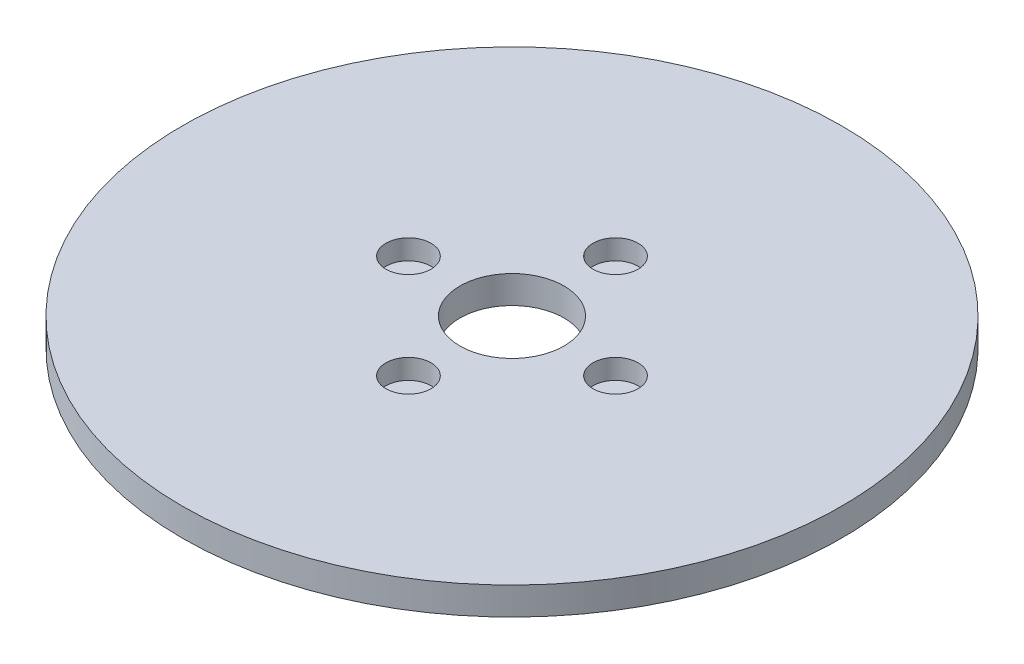
ISO-10303-21;
HEADER;
FILE_DESCRIPTION(('STEP AP214'),'2;1');
FILE_NAME('part.step','',(''),(''),'','','');
FILE_SCHEMA(('AUTOMOTIVE_DESIGN { 1 0 10303 214 1 1 1 1 }'));
ENDSEC;
DATA;
#1=APPLICATION_CONTEXT('core data for automotive mechanical design processes');
#2=APPLICATION_PROTOCOL_DEFINITION('international standard','automotive_design',2000,#1);
#3=PRODUCT_CONTEXT('',#1,'mechanical');
#4=PRODUCT('Part','Part','',(#3));
#5=PRODUCT_RELATED_PRODUCT_CATEGORY('part','',(#4));
#6=PRODUCT_DEFINITION_FORMATION('','',#4);
#7=PRODUCT_DEFINITION_CONTEXT('part definition',#1,'design');
#8=PRODUCT_DEFINITION('design','',#6,#7);
#9=PRODUCT_DEFINITION_SHAPE('','',#8);
#10=(LENGTH_UNIT() NAMED_UNIT(*) SI_UNIT(.MILLI.,.METRE.));
#11=(NAMED_UNIT(*) PLANE_ANGLE_UNIT() SI_UNIT($,.RADIAN.));
#12=(NAMED_UNIT(*) SI_UNIT($,.STERADIAN.) SOLID_ANGLE_UNIT());
#13=UNCERTAINTY_MEASURE_WITH_UNIT(LENGTH_MEASURE(1.E-05),#10,'distance_accuracy_value','');
#14=(GEOMETRIC_REPRESENTATION_CONTEXT(3) GLOBAL_UNCERTAINTY_ASSIGNED_CONTEXT((#13)) GLOBAL_UNIT_ASSIGNED_CONTEXT((#10,
#11,#12)) REPRESENTATION_CONTEXT('',''));
#15=CARTESIAN_POINT('',(0.,0.,0.));
#16=DIRECTION('',(0.,0.,1.));
#17=DIRECTION('',(1.,0.,0.));
#18=AXIS2_PLACEMENT_3D('',#15,#16,#17);
#19=CARTESIAN_POINT('',(0.,8.,0.));
#20=DIRECTION('',(0.,-1.,0.));
#21=DIRECTION('',(0.,0.,-1.));
#22=AXIS2_PLACEMENT_3D('',#19,#20,#21);
#23=CYLINDRICAL_SURFACE('',#22,95.);
#24=CARTESIAN_POINT('',(0.,8.,0.));
#25=DIRECTION('',(0.,1.,0.));
#26=DIRECTION('',(0.,0.,1.));
#27=AXIS2_PLACEMENT_3D('',#24,#25,#26);
#28=CIRCLE('',#27,95.);
#29=CARTESIAN_POINT('',(0.,8.,95.));
#30=VERTEX_POINT('',#29);
#31=EDGE_CURVE('E10',#30,#30,#28,.T.);
#32=ORIENTED_EDGE('',*,*,#31,.F.);
#33=EDGE_LOOP('',(#32));
#34=FACE_BOUND('',#33,.T.);
#35=CARTESIAN_POINT('',(0.,0.,0.));
#36=DIRECTION('',(0.,1.,0.));
#37=DIRECTION('',(0.,0.,1.));
#38=AXIS2_PLACEMENT_3D('',#35,#36,#37);
#39=CIRCLE('',#38,95.);
#40=CARTESIAN_POINT('',(0.,0.,95.));
#41=VERTEX_POINT('',#40);
#42=EDGE_CURVE('E37',#41,#41,#39,.T.);
#43=ORIENTED_EDGE('',*,*,#42,.T.);
#44=EDGE_LOOP('',(#43));
#45=FACE_BOUND('',#44,.T.);
#46=ADVANCED_FACE('F40',(#34,#45),#23,.T.);
#47=CARTESIAN_POINT('',(0.,8.,0.));
#48=DIRECTION('',(0.,1.,0.));
#49=DIRECTION('',(0.,0.,1.));
#50=AXIS2_PLACEMENT_3D('',#47,#48,#49);
#51=PLANE('',#50);
#52=CARTESIAN_POINT('',(1.04206870523359E-13,8.,29.8460339352371));
#53=DIRECTION('',(0.,1.,0.));
#54=DIRECTION('',(1.,0.,0.));
#55=AXIS2_PLACEMENT_3D('',#52,#53,#54);
#56=CIRCLE('',#55,6.49747488358835);
#57=CARTESIAN_POINT('',(1.04206870523359E-13,8.,36.3435088188255));
#58=VERTEX_POINT('',#57);
#59=EDGE_CURVE('E71',#58,#58,#56,.T.);
#60=ORIENTED_EDGE('',*,*,#59,.F.);
#61=EDGE_LOOP('',(#60));
#62=FACE_BOUND('',#61,.T.);
#63=CARTESIAN_POINT('',(29.8460339352371,8.,0.));
#64=DIRECTION('',(0.,1.,0.));
#65=DIRECTION('',(0.,0.,-1.));
#66=AXIS2_PLACEMENT_3D('',#63,#64,#65);
#67=CIRCLE('',#66,6.49747488358835);
#68=CARTESIAN_POINT('',(29.8460339352371,8.,6.49747488358835));
#69=VERTEX_POINT('',#68);
#70=EDGE_CURVE('E70',#69,#69,#67,.T.);
#71=ORIENTED_EDGE('',*,*,#70,.F.);
#72=EDGE_LOOP('',(#71));
#73=FACE_BOUND('',#72,.T.);
#74=CARTESIAN_POINT('',(-3.12620611570078E-13,8.,-29.8460339352371));
#75=DIRECTION('',(0.,1.,0.));
#76=DIRECTION('',(-1.,0.,0.));
#77=AXIS2_PLACEMENT_3D('',#74,#75,#76);
#78=CIRCLE('',#77,6.49747488358835);
#79=CARTESIAN_POINT('',(-3.12620611570078E-13,8.,-23.3485590516488));
#80=VERTEX_POINT('',#79);
#81=EDGE_CURVE('E61',#80,#80,#78,.T.);
#82=ORIENTED_EDGE('',*,*,#81,.F.);
#83=EDGE_LOOP('',(#82));
#84=FACE_BOUND('',#83,.T.);
#85=CARTESIAN_POINT('',(-29.8460339352371,8.,0.));
#86=DIRECTION('',(0.,1.,0.));
#87=DIRECTION('',(0.,0.,1.));
#88=AXIS2_PLACEMENT_3D('',#85,#86,#87);
#89=CIRCLE('',#88,6.49747488358835);
#90=CARTESIAN_POINT('',(-29.8460339352371,8.,6.49747488358835));
#91=VERTEX_POINT('',#90);
#92=EDGE_CURVE('E54',#91,#91,#89,.T.);
#93=ORIENTED_EDGE('',*,*,#92,.F.);
#94=EDGE_LOOP('',(#93));
#95=FACE_BOUND('',#94,.T.);
#96=CARTESIAN_POINT('',(0.,8.,0.));
#97=DIRECTION('',(0.,1.,0.));
#98=DIRECTION('',(0.,0.,1.));
#99=AXIS2_PLACEMENT_3D('',#96,#97,#98);
#100=CIRCLE('',#99,15.);
#101=CARTESIAN_POINT('',(0.,8.,15.));
#102=VERTEX_POINT('',#101);
#103=EDGE_CURVE('E50',#102,#102,#100,.T.);
#104=ORIENTED_EDGE('',*,*,#103,.F.);
#105=EDGE_LOOP('',(#104));
#106=FACE_BOUND('',#105,.T.);
#107=ORIENTED_EDGE('',*,*,#31,.T.);
#108=EDGE_LOOP('',(#107));
#109=FACE_BOUND('',#108,.T.);
#110=ADVANCED_FACE('F86',(#62,#73,#84,#95,#106,#109),#51,.T.);
#111=CARTESIAN_POINT('',(0.,0.,0.));
#112=DIRECTION('',(0.,1.,0.));
#113=DIRECTION('',(0.,0.,1.));
#114=AXIS2_PLACEMENT_3D('',#111,#112,#113);
#115=PLANE('',#114);
#116=CARTESIAN_POINT('',(0.,0.,0.));
#117=DIRECTION('',(0.,1.,0.));
#118=DIRECTION('',(0.,0.,1.));
#119=AXIS2_PLACEMENT_3D('',#116,#117,#118);
#120=CIRCLE('',#119,15.);
#121=CARTESIAN_POINT('',(0.,0.,15.));
#122=VERTEX_POINT('',#121);
#123=EDGE_CURVE('E47',#122,#122,#120,.T.);
#124=ORIENTED_EDGE('',*,*,#123,.T.);
#125=EDGE_LOOP('',(#124));
#126=FACE_BOUND('',#125,.T.);
#127=ORIENTED_EDGE('',*,*,#42,.F.);
#128=EDGE_LOOP('',(#127));
#129=FACE_BOUND('',#128,.T.);
#130=ADVANCED_FACE('F93',(#126,#129),#115,.F.);
#131=CARTESIAN_POINT('',(0.,8.,0.));
#132=DIRECTION('',(0.,-1.,0.));
#133=DIRECTION('',(0.,0.,-1.));
#134=AXIS2_PLACEMENT_3D('',#131,#132,#133);
#135=CYLINDRICAL_SURFACE('',#134,15.);
#136=ORIENTED_EDGE('',*,*,#103,.T.);
#137=EDGE_LOOP('',(#136));
#138=FACE_BOUND('',#137,.T.);
#139=ORIENTED_EDGE('',*,*,#123,.F.);
#140=EDGE_LOOP('',(#139));
#141=FACE_BOUND('',#140,.T.);
#142=ADVANCED_FACE('F101',(#138,#141),#135,.F.);
#143=CARTESIAN_POINT('',(-29.8460339352371,2.25266147835469,0.));
#144=DIRECTION('',(0.,1.,0.));
#145=DIRECTION('',(0.,0.,1.));
#146=AXIS2_PLACEMENT_3D('',#143,#144,#145);
#147=CYLINDRICAL_SURFACE('',#146,6.49747488358835);
#148=CARTESIAN_POINT('',(-29.8460339352371,2.25266147835469,0.));
#149=DIRECTION('',(0.,1.,0.));
#150=DIRECTION('',(0.,0.,1.));
#151=AXIS2_PLACEMENT_3D('',#148,#149,#150);
#152=CIRCLE('',#151,6.49747488358835);
#153=CARTESIAN_POINT('',(-29.8460339352371,2.25266147835469,6.49747488358835));
#154=VERTEX_POINT('',#153);
#155=EDGE_CURVE('E55',#154,#154,#152,.T.);
#156=CARTESIAN_POINT('',(-29.8460339352371,2.25266147835469,6.49747488358835));
#157=CARTESIAN_POINT('',(-29.8460339352371,2.31252958795517,6.49747488358835));
#158=CARTESIAN_POINT('',(-29.8460339352371,2.37239769755564,6.49747488358835));
#159=CARTESIAN_POINT('',(-29.8460339352371,2.49213391675658,6.49747488358835));
#160=CARTESIAN_POINT('',(-29.8460339352371,2.55200202635705,6.49747488358835));
#161=CARTESIAN_POINT('',(-29.8460339352371,2.671738245558,6.49747488358835));
#162=CARTESIAN_POINT('',(-29.8460339352371,2.73160635515847,6.49747488358835));
#163=CARTESIAN_POINT('',(-29.8460339352371,2.85134257435941,6.49747488358835));
#164=CARTESIAN_POINT('',(-29.8460339352371,2.91121068395989,6.49747488358835));
#165=CARTESIAN_POINT('',(-29.8460339352371,3.03094690316083,6.49747488358835));
#166=CARTESIAN_POINT('',(-29.8460339352371,3.0908150127613,6.49747488358835));
#167=CARTESIAN_POINT('',(-29.8460339352371,3.21055123196224,6.49747488358835));
#168=CARTESIAN_POINT('',(-29.8460339352371,3.27041934156272,6.49747488358835));
#169=CARTESIAN_POINT('',(-29.8460339352371,3.39015556076366,6.49747488358835));
#170=CARTESIAN_POINT('',(-29.8460339352371,3.45002367036413,6.49747488358835));
#171=CARTESIAN_POINT('',(-29.8460339352371,3.56975988956508,6.49747488358835));
#172=CARTESIAN_POINT('',(-29.8460339352371,3.62962799916555,6.49747488358835));
#173=CARTESIAN_POINT('',(-29.8460339352371,3.74936421836649,6.49747488358835));
#174=CARTESIAN_POINT('',(-29.8460339352371,3.80923232796696,6.49747488358835));
#175=CARTESIAN_POINT('',(-29.8460339352371,3.92896854716791,6.49747488358835));
#176=CARTESIAN_POINT('',(-29.8460339352371,3.98883665676838,6.49747488358835));
#177=CARTESIAN_POINT('',(-29.8460339352371,4.10857287596932,6.49747488358835));
#178=CARTESIAN_POINT('',(-29.8460339352371,4.1684409855698,6.49747488358835));
#179=CARTESIAN_POINT('',(-29.8460339352371,4.28817720477074,6.49747488358835));
#180=CARTESIAN_POINT('',(-29.8460339352371,4.34804531437121,6.49747488358835));
#181=CARTESIAN_POINT('',(-29.8460339352371,4.46778153357215,6.49747488358835));
#182=CARTESIAN_POINT('',(-29.8460339352371,4.52764964317263,6.49747488358835));
#183=CARTESIAN_POINT('',(-29.8460339352371,4.64738586237357,6.49747488358835));
#184=CARTESIAN_POINT('',(-29.8460339352371,4.70725397197404,6.49747488358835));
#185=CARTESIAN_POINT('',(-29.8460339352371,4.82699019117499,6.49747488358835));
#186=CARTESIAN_POINT('',(-29.8460339352371,4.88685830077546,6.49747488358835));
#187=CARTESIAN_POINT('',(-29.8460339352371,5.0065945199764,6.49747488358835));
#188=CARTESIAN_POINT('',(-29.8460339352371,5.06646262957687,6.49747488358835));
#189=CARTESIAN_POINT('',(-29.8460339352371,5.18619884877782,6.49747488358835));
#190=CARTESIAN_POINT('',(-29.8460339352371,5.24606695837829,6.49747488358835));
#191=CARTESIAN_POINT('',(-29.8460339352371,5.36580317757923,6.49747488358835));
#192=CARTESIAN_POINT('',(-29.8460339352371,5.42567128717971,6.49747488358835));
#193=CARTESIAN_POINT('',(-29.8460339352371,5.54540750638065,6.49747488358835));
#194=CARTESIAN_POINT('',(-29.8460339352371,5.60527561598112,6.49747488358835));
#195=CARTESIAN_POINT('',(-29.8460339352371,5.72501183518207,6.49747488358835));
#196=CARTESIAN_POINT('',(-29.8460339352371,5.78487994478254,6.49747488358835));
#197=CARTESIAN_POINT('',(-29.8460339352371,5.90461616398348,6.49747488358835));
#198=CARTESIAN_POINT('',(-29.8460339352371,5.96448427358395,6.49747488358835));
#199=CARTESIAN_POINT('',(-29.8460339352371,6.0842204927849,6.49747488358835));
#200=CARTESIAN_POINT('',(-29.8460339352371,6.14408860238537,6.49747488358835));
#201=CARTESIAN_POINT('',(-29.8460339352371,6.26382482158631,6.49747488358835));
#202=CARTESIAN_POINT('',(-29.8460339352371,6.32369293118678,6.49747488358835));
#203=CARTESIAN_POINT('',(-29.8460339352371,6.44342915038773,6.49747488358835));
#204=CARTESIAN_POINT('',(-29.8460339352371,6.5032972599882,6.49747488358835));
#205=CARTESIAN_POINT('',(-29.8460339352371,6.62303347918914,6.49747488358835));
#206=CARTESIAN_POINT('',(-29.8460339352371,6.68290158878962,6.49747488358835));
#207=CARTESIAN_POINT('',(-29.8460339352371,6.80263780799056,6.49747488358835));
#208=CARTESIAN_POINT('',(-29.8460339352371,6.86250591759103,6.49747488358835));
#209=CARTESIAN_POINT('',(-29.8460339352371,6.98224213679198,6.49747488358835));
#210=CARTESIAN_POINT('',(-29.8460339352371,7.04211024639245,6.49747488358835));
#211=CARTESIAN_POINT('',(-29.8460339352371,7.16184646559339,6.49747488358835));
#212=CARTESIAN_POINT('',(-29.8460339352371,7.22171457519386,6.49747488358835));
#213=CARTESIAN_POINT('',(-29.8460339352371,7.34145079439481,6.49747488358835));
#214=CARTESIAN_POINT('',(-29.8460339352371,7.40131890399528,6.49747488358835));
#215=CARTESIAN_POINT('',(-29.8460339352371,7.52105512319622,6.49747488358835));
#216=CARTESIAN_POINT('',(-29.8460339352371,7.5809232327967,6.49747488358835));
#217=CARTESIAN_POINT('',(-29.8460339352371,7.70065945199764,6.49747488358835));
#218=CARTESIAN_POINT('',(-29.8460339352371,7.76052756159811,6.49747488358835));
#219=CARTESIAN_POINT('',(-29.8460339352371,7.88026378079906,6.49747488358835));
#220=CARTESIAN_POINT('',(-29.8460339352371,7.94013189039953,6.49747488358835));
#221=CARTESIAN_POINT('',(-29.8460339352371,8.,6.49747488358835));
#222=B_SPLINE_CURVE_WITH_KNOTS('',3,(#156,#157,#158,#159,#160,#161,#162,#163,#164,#165,#166,
#167,#168,#169,#170,#171,#172,#173,#174,#175,#176,#177,#178,#179,#180,#181,#182,#183,#184,#185,
#186,#187,#188,#189,#190,#191,#192,#193,#194,#195,#196,#197,#198,#199,#200,#201,#202,#203,#204,
#205,#206,#207,#208,#209,#210,#211,#212,#213,#214,#215,#216,#217,#218,#219,#220,#221),
.UNSPECIFIED.,.F.,.F.,(4,2,2,2,2,2,2,2,2,2,2,2,2,2,2,2,2,2,2,2,2,2,2,2,2,2,2,2,2,2,2,2,4),(0.,
0.179604328801416,0.359208657602832,0.538812986404247,0.718417315205663,0.898021644007079,
1.07762597280849,1.25723030160991,1.43683463041133,1.61643895921274,1.79604328801416,
1.97564761681557,2.15525194561699,2.3348562744184,2.51446060321982,2.69406493202124,
2.87366926082265,3.05327358962407,3.23287791842548,3.4124822472269,3.59208657602831,
3.77169090482973,3.95129523363115,4.13089956243256,4.31050389123398,4.49010822003539,
4.66971254883681,4.84931687763822,5.02892120643964,5.20852553524106,5.38812986404247,
5.56773419284389,5.7473385216453),.UNSPECIFIED.);
#223=EDGE_CURVE('BSEAM102',#154,#91,#222,.T.);
#224=ORIENTED_EDGE('',*,*,#155,.F.);
#225=ORIENTED_EDGE('',*,*,#92,.T.);
#226=ORIENTED_EDGE('',*,*,#223,.T.);
#227=ORIENTED_EDGE('',*,*,#223,.F.);
#228=EDGE_LOOP('',(#224,#226,#225,#227));
#229=FACE_BOUND('',#228,.T.);
#230=ADVANCED_FACE('F102',(#229),#147,.F.);
#231=CARTESIAN_POINT('',(-29.8460339352371,2.25266147835469,0.));
#232=DIRECTION('',(0.,1.,0.));
#233=DIRECTION('',(0.,0.,1.));
#234=AXIS2_PLACEMENT_3D('',#231,#232,#233);
#235=PLANE('',#234);
#236=ORIENTED_EDGE('',*,*,#155,.T.);
#237=EDGE_LOOP('',(#236));
#238=FACE_BOUND('',#237,.T.);
#239=ADVANCED_FACE('F133',(#238),#235,.T.);
#240=CARTESIAN_POINT('',(-3.12620611570078E-13,2.25266147835469,-29.8460339352371));
#241=DIRECTION('',(0.,1.,0.));
#242=DIRECTION('',(0.,0.,1.));
#243=AXIS2_PLACEMENT_3D('',#240,#241,#242);
#244=CYLINDRICAL_SURFACE('',#243,6.49747488358835);
#245=CARTESIAN_POINT('',(-3.12620611570078E-13,2.25266147835469,-29.8460339352371));
#246=DIRECTION('',(0.,1.,0.));
#247=DIRECTION('',(-1.,0.,0.));
#248=AXIS2_PLACEMENT_3D('',#245,#246,#247);
#249=CIRCLE('',#248,6.49747488358835);
#250=CARTESIAN_POINT('',(-3.12620611570078E-13,2.25266147835469,-23.3485590516488));
#251=VERTEX_POINT('',#250);
#252=EDGE_CURVE('E63',#251,#251,#249,.T.);
#253=CARTESIAN_POINT('',(-3.12620611570078E-13,2.25266147835469,-23.3485590516488));
#254=CARTESIAN_POINT('',(-3.12620611570078E-13,2.31252958795517,-23.3485590516488));
#255=CARTESIAN_POINT('',(-3.12620611570078E-13,2.37239769755564,-23.3485590516488));
#256=CARTESIAN_POINT('',(-3.12620611570078E-13,2.49213391675658,-23.3485590516488));
#257=CARTESIAN_POINT('',(-3.12620611570078E-13,2.55200202635705,-23.3485590516488));
#258=CARTESIAN_POINT('',(-3.12620611570078E-13,2.671738245558,-23.3485590516488));
#259=CARTESIAN_POINT('',(-3.12620611570078E-13,2.73160635515847,-23.3485590516488));
#260=CARTESIAN_POINT('',(-3.12620611570078E-13,2.85134257435941,-23.3485590516488));
#261=CARTESIAN_POINT('',(-3.12620611570078E-13,2.91121068395989,-23.3485590516488));
#262=CARTESIAN_POINT('',(-3.12620611570078E-13,3.03094690316083,-23.3485590516488));
#263=CARTESIAN_POINT('',(-3.12620611570078E-13,3.0908150127613,-23.3485590516488));
#264=CARTESIAN_POINT('',(-3.12620611570078E-13,3.21055123196224,-23.3485590516488));
#265=CARTESIAN_POINT('',(-3.12620611570078E-13,3.27041934156272,-23.3485590516488));
#266=CARTESIAN_POINT('',(-3.12620611570078E-13,3.39015556076366,-23.3485590516488));
#267=CARTESIAN_POINT('',(-3.12620611570078E-13,3.45002367036413,-23.3485590516488));
#268=CARTESIAN_POINT('',(-3.12620611570078E-13,3.56975988956508,-23.3485590516488));
#269=CARTESIAN_POINT('',(-3.12620611570078E-13,3.62962799916555,-23.3485590516488));
#270=CARTESIAN_POINT('',(-3.12620611570078E-13,3.74936421836649,-23.3485590516488));
#271=CARTESIAN_POINT('',(-3.12620611570078E-13,3.80923232796696,-23.3485590516488));
#272=CARTESIAN_POINT('',(-3.12620611570078E-13,3.92896854716791,-23.3485590516488));
#273=CARTESIAN_POINT('',(-3.12620611570078E-13,3.98883665676838,-23.3485590516488));
#274=CARTESIAN_POINT('',(-3.12620611570078E-13,4.10857287596932,-23.3485590516488));
#275=CARTESIAN_POINT('',(-3.12620611570078E-13,4.1684409855698,-23.3485590516488));
#276=CARTESIAN_POINT('',(-3.12620611570078E-13,4.28817720477074,-23.3485590516488));
#277=CARTESIAN_POINT('',(-3.12620611570078E-13,4.34804531437121,-23.3485590516488));
#278=CARTESIAN_POINT('',(-3.12620611570078E-13,4.46778153357215,-23.3485590516488));
#279=CARTESIAN_POINT('',(-3.12620611570078E-13,4.52764964317263,-23.3485590516488));
#280=CARTESIAN_POINT('',(-3.12620611570078E-13,4.64738586237357,-23.3485590516488));
#281=CARTESIAN_POINT('',(-3.12620611570078E-13,4.70725397197404,-23.3485590516488));
#282=CARTESIAN_POINT('',(-3.12620611570078E-13,4.82699019117499,-23.3485590516488));
#283=CARTESIAN_POINT('',(-3.12620611570078E-13,4.88685830077546,-23.3485590516488));
#284=CARTESIAN_POINT('',(-3.12620611570078E-13,5.0065945199764,-23.3485590516488));
#285=CARTESIAN_POINT('',(-3.12620611570078E-13,5.06646262957687,-23.3485590516488));
#286=CARTESIAN_POINT('',(-3.12620611570078E-13,5.18619884877782,-23.3485590516488));
#287=CARTESIAN_POINT('',(-3.12620611570078E-13,5.24606695837829,-23.3485590516488));
#288=CARTESIAN_POINT('',(-3.12620611570078E-13,5.36580317757923,-23.3485590516488));
#289=CARTESIAN_POINT('',(-3.12620611570078E-13,5.42567128717971,-23.3485590516488));
#290=CARTESIAN_POINT('',(-3.12620611570078E-13,5.54540750638065,-23.3485590516488));
#291=CARTESIAN_POINT('',(-3.12620611570078E-13,5.60527561598112,-23.3485590516488));
#292=CARTESIAN_POINT('',(-3.12620611570078E-13,5.72501183518207,-23.3485590516488));
#293=CARTESIAN_POINT('',(-3.12620611570078E-13,5.78487994478254,-23.3485590516488));
#294=CARTESIAN_POINT('',(-3.12620611570078E-13,5.90461616398348,-23.3485590516488));
#295=CARTESIAN_POINT('',(-3.12620611570078E-13,5.96448427358395,-23.3485590516488));
#296=CARTESIAN_POINT('',(-3.12620611570078E-13,6.0842204927849,-23.3485590516488));
#297=CARTESIAN_POINT('',(-3.12620611570078E-13,6.14408860238537,-23.3485590516488));
#298=CARTESIAN_POINT('',(-3.12620611570078E-13,6.26382482158631,-23.3485590516488));
#299=CARTESIAN_POINT('',(-3.12620611570078E-13,6.32369293118678,-23.3485590516488));
#300=CARTESIAN_POINT('',(-3.12620611570078E-13,6.44342915038773,-23.3485590516488));
#301=CARTESIAN_POINT('',(-3.12620611570078E-13,6.5032972599882,-23.3485590516488));
#302=CARTESIAN_POINT('',(-3.12620611570078E-13,6.62303347918914,-23.3485590516488));
#303=CARTESIAN_POINT('',(-3.12620611570078E-13,6.68290158878962,-23.3485590516488));
#304=CARTESIAN_POINT('',(-3.12620611570078E-13,6.80263780799056,-23.3485590516488));
#305=CARTESIAN_POINT('',(-3.12620611570078E-13,6.86250591759103,-23.3485590516488));
#306=CARTESIAN_POINT('',(-3.12620611570078E-13,6.98224213679198,-23.3485590516488));
#307=CARTESIAN_POINT('',(-3.12620611570078E-13,7.04211024639245,-23.3485590516488));
#308=CARTESIAN_POINT('',(-3.12620611570078E-13,7.16184646559339,-23.3485590516488));
#309=CARTESIAN_POINT('',(-3.12620611570078E-13,7.22171457519386,-23.3485590516488));
#310=CARTESIAN_POINT('',(-3.12620611570078E-13,7.34145079439481,-23.3485590516488));
#311=CARTESIAN_POINT('',(-3.12620611570078E-13,7.40131890399528,-23.3485590516488));
#312=CARTESIAN_POINT('',(-3.12620611570078E-13,7.52105512319622,-23.3485590516488));
#313=CARTESIAN_POINT('',(-3.12620611570078E-13,7.5809232327967,-23.3485590516488));
#314=CARTESIAN_POINT('',(-3.12620611570078E-13,7.70065945199764,-23.3485590516488));
#315=CARTESIAN_POINT('',(-3.12620611570078E-13,7.76052756159811,-23.3485590516488));
#316=CARTESIAN_POINT('',(-3.12620611570078E-13,7.88026378079906,-23.3485590516488));
#317=CARTESIAN_POINT('',(-3.12620611570078E-13,7.94013189039953,-23.3485590516488));
#318=CARTESIAN_POINT('',(-3.12620611570078E-13,8.,-23.3485590516488));
#319=B_SPLINE_CURVE_WITH_KNOTS('',3,(#253,#254,#255,#256,#257,#258,#259,#260,#261,#262,#263,
#264,#265,#266,#267,#268,#269,#270,#271,#272,#273,#274,#275,#276,#277,#278,#279,#280,#281,#282,
#283,#284,#285,#286,#287,#288,#289,#290,#291,#292,#293,#294,#295,#296,#297,#298,#299,#300,#301,
#302,#303,#304,#305,#306,#307,#308,#309,#310,#311,#312,#313,#314,#315,#316,#317,#318),
.UNSPECIFIED.,.F.,.F.,(4,2,2,2,2,2,2,2,2,2,2,2,2,2,2,2,2,2,2,2,2,2,2,2,2,2,2,2,2,2,2,2,4),(0.,
0.179604328801416,0.359208657602832,0.538812986404247,0.718417315205663,0.898021644007079,
1.07762597280849,1.25723030160991,1.43683463041133,1.61643895921274,1.79604328801416,
1.97564761681557,2.15525194561699,2.3348562744184,2.51446060321982,2.69406493202124,
2.87366926082265,3.05327358962407,3.23287791842548,3.4124822472269,3.59208657602831,
3.77169090482973,3.95129523363115,4.13089956243256,4.31050389123398,4.49010822003539,
4.66971254883681,4.84931687763822,5.02892120643964,5.20852553524106,5.38812986404247,
5.56773419284389,5.7473385216453),.UNSPECIFIED.);
#320=EDGE_CURVE('BSEAM142',#251,#80,#319,.T.);
#321=ORIENTED_EDGE('',*,*,#252,.F.);
#322=ORIENTED_EDGE('',*,*,#81,.T.);
#323=ORIENTED_EDGE('',*,*,#320,.T.);
#324=ORIENTED_EDGE('',*,*,#320,.F.);
#325=EDGE_LOOP('',(#321,#323,#322,#324));
#326=FACE_BOUND('',#325,.T.);
#327=ADVANCED_FACE('F142',(#326),#244,.F.);
#328=CARTESIAN_POINT('',(-3.12620611570078E-13,2.25266147835469,-29.8460339352371));
#329=DIRECTION('',(0.,1.,0.));
#330=DIRECTION('',(-1.,0.,0.));
#331=AXIS2_PLACEMENT_3D('',#328,#329,#330);
#332=PLANE('',#331);
#333=ORIENTED_EDGE('',*,*,#252,.T.);
#334=EDGE_LOOP('',(#333));
#335=FACE_BOUND('',#334,.T.);
#336=ADVANCED_FACE('F156',(#335),#332,.T.);
#337=CARTESIAN_POINT('',(29.8460339352371,2.25266147835469,0.));
#338=DIRECTION('',(0.,1.,0.));
#339=DIRECTION('',(0.,0.,1.));
#340=AXIS2_PLACEMENT_3D('',#337,#338,#339);
#341=CYLINDRICAL_SURFACE('',#340,6.49747488358835);
#342=CARTESIAN_POINT('',(29.8460339352371,2.25266147835469,0.));
#343=DIRECTION('',(0.,1.,0.));
#344=DIRECTION('',(0.,0.,-1.));
#345=AXIS2_PLACEMENT_3D('',#342,#343,#344);
#346=CIRCLE('',#345,6.49747488358835);
#347=CARTESIAN_POINT('',(29.8460339352371,2.25266147835469,6.49747488358835));
#348=VERTEX_POINT('',#347);
#349=EDGE_CURVE('E69',#348,#348,#346,.T.);
#350=CARTESIAN_POINT('',(29.8460339352371,2.25266147835469,6.49747488358835));
#351=CARTESIAN_POINT('',(29.8460339352371,2.31252958795517,6.49747488358835));
#352=CARTESIAN_POINT('',(29.8460339352371,2.37239769755564,6.49747488358835));
#353=CARTESIAN_POINT('',(29.8460339352371,2.49213391675658,6.49747488358835));
#354=CARTESIAN_POINT('',(29.8460339352371,2.55200202635705,6.49747488358835));
#355=CARTESIAN_POINT('',(29.8460339352371,2.671738245558,6.49747488358835));
#356=CARTESIAN_POINT('',(29.8460339352371,2.73160635515847,6.49747488358835));
#357=CARTESIAN_POINT('',(29.8460339352371,2.85134257435941,6.49747488358835));
#358=CARTESIAN_POINT('',(29.8460339352371,2.91121068395989,6.49747488358835));
#359=CARTESIAN_POINT('',(29.8460339352371,3.03094690316083,6.49747488358835));
#360=CARTESIAN_POINT('',(29.8460339352371,3.0908150127613,6.49747488358835));
#361=CARTESIAN_POINT('',(29.8460339352371,3.21055123196224,6.49747488358835));
#362=CARTESIAN_POINT('',(29.8460339352371,3.27041934156272,6.49747488358835));
#363=CARTESIAN_POINT('',(29.8460339352371,3.39015556076366,6.49747488358835));
#364=CARTESIAN_POINT('',(29.8460339352371,3.45002367036413,6.49747488358835));
#365=CARTESIAN_POINT('',(29.8460339352371,3.56975988956508,6.49747488358835));
#366=CARTESIAN_POINT('',(29.8460339352371,3.62962799916555,6.49747488358835));
#367=CARTESIAN_POINT('',(29.8460339352371,3.74936421836649,6.49747488358835));
#368=CARTESIAN_POINT('',(29.8460339352371,3.80923232796696,6.49747488358835));
#369=CARTESIAN_POINT('',(29.8460339352371,3.92896854716791,6.49747488358835));
#370=CARTESIAN_POINT('',(29.8460339352371,3.98883665676838,6.49747488358835));
#371=CARTESIAN_POINT('',(29.8460339352371,4.10857287596932,6.49747488358835));
#372=CARTESIAN_POINT('',(29.8460339352371,4.1684409855698,6.49747488358835));
#373=CARTESIAN_POINT('',(29.8460339352371,4.28817720477074,6.49747488358835));
#374=CARTESIAN_POINT('',(29.8460339352371,4.34804531437121,6.49747488358835));
#375=CARTESIAN_POINT('',(29.8460339352371,4.46778153357215,6.49747488358835));
#376=CARTESIAN_POINT('',(29.8460339352371,4.52764964317263,6.49747488358835));
#377=CARTESIAN_POINT('',(29.8460339352371,4.64738586237357,6.49747488358835));
#378=CARTESIAN_POINT('',(29.8460339352371,4.70725397197404,6.49747488358835));
#379=CARTESIAN_POINT('',(29.8460339352371,4.82699019117499,6.49747488358835));
#380=CARTESIAN_POINT('',(29.8460339352371,4.88685830077546,6.49747488358835));
#381=CARTESIAN_POINT('',(29.8460339352371,5.0065945199764,6.49747488358835));
#382=CARTESIAN_POINT('',(29.8460339352371,5.06646262957687,6.49747488358835));
#383=CARTESIAN_POINT('',(29.8460339352371,5.18619884877782,6.49747488358835));
#384=CARTESIAN_POINT('',(29.8460339352371,5.24606695837829,6.49747488358835));
#385=CARTESIAN_POINT('',(29.8460339352371,5.36580317757923,6.49747488358835));
#386=CARTESIAN_POINT('',(29.8460339352371,5.42567128717971,6.49747488358835));
#387=CARTESIAN_POINT('',(29.8460339352371,5.54540750638065,6.49747488358835));
#388=CARTESIAN_POINT('',(29.8460339352371,5.60527561598112,6.49747488358835));
#389=CARTESIAN_POINT('',(29.8460339352371,5.72501183518207,6.49747488358835));
#390=CARTESIAN_POINT('',(29.8460339352371,5.78487994478254,6.49747488358835));
#391=CARTESIAN_POINT('',(29.8460339352371,5.90461616398348,6.49747488358835));
#392=CARTESIAN_POINT('',(29.8460339352371,5.96448427358395,6.49747488358835));
#393=CARTESIAN_POINT('',(29.8460339352371,6.0842204927849,6.49747488358835));
#394=CARTESIAN_POINT('',(29.8460339352371,6.14408860238537,6.49747488358835));
#395=CARTESIAN_POINT('',(29.8460339352371,6.26382482158631,6.49747488358835));
#396=CARTESIAN_POINT('',(29.8460339352371,6.32369293118678,6.49747488358835));
#397=CARTESIAN_POINT('',(29.8460339352371,6.44342915038773,6.49747488358835));
#398=CARTESIAN_POINT('',(29.8460339352371,6.5032972599882,6.49747488358835));
#399=CARTESIAN_POINT('',(29.8460339352371,6.62303347918914,6.49747488358835));
#400=CARTESIAN_POINT('',(29.8460339352371,6.68290158878962,6.49747488358835));
#401=CARTESIAN_POINT('',(29.8460339352371,6.80263780799056,6.49747488358835));
#402=CARTESIAN_POINT('',(29.8460339352371,6.86250591759103,6.49747488358835));
#403=CARTESIAN_POINT('',(29.8460339352371,6.98224213679198,6.49747488358835));
#404=CARTESIAN_POINT('',(29.8460339352371,7.04211024639245,6.49747488358835));
#405=CARTESIAN_POINT('',(29.8460339352371,7.16184646559339,6.49747488358835));
#406=CARTESIAN_POINT('',(29.8460339352371,7.22171457519386,6.49747488358835));
#407=CARTESIAN_POINT('',(29.8460339352371,7.34145079439481,6.49747488358835));
#408=CARTESIAN_POINT('',(29.8460339352371,7.40131890399528,6.49747488358835));
#409=CARTESIAN_POINT('',(29.8460339352371,7.52105512319622,6.49747488358835));
#410=CARTESIAN_POINT('',(29.8460339352371,7.5809232327967,6.49747488358835));
#411=CARTESIAN_POINT('',(29.8460339352371,7.70065945199764,6.49747488358835));
#412=CARTESIAN_POINT('',(29.8460339352371,7.76052756159811,6.49747488358835));
#413=CARTESIAN_POINT('',(29.8460339352371,7.88026378079906,6.49747488358835));
#414=CARTESIAN_POINT('',(29.8460339352371,7.94013189039953,6.49747488358835));
#415=CARTESIAN_POINT('',(29.8460339352371,8.,6.49747488358835));
#416=B_SPLINE_CURVE_WITH_KNOTS('',3,(#350,#351,#352,#353,#354,#355,#356,#357,#358,#359,#360,
#361,#362,#363,#364,#365,#366,#367,#368,#369,#370,#371,#372,#373,#374,#375,#376,#377,#378,#379,
#380,#381,#382,#383,#384,#385,#386,#387,#388,#389,#390,#391,#392,#393,#394,#395,#396,#397,#398,
#399,#400,#401,#402,#403,#404,#405,#406,#407,#408,#409,#410,#411,#412,#413,#414,#415),
.UNSPECIFIED.,.F.,.F.,(4,2,2,2,2,2,2,2,2,2,2,2,2,2,2,2,2,2,2,2,2,2,2,2,2,2,2,2,2,2,2,2,4),(0.,
0.179604328801416,0.359208657602832,0.538812986404247,0.718417315205663,0.898021644007079,
1.07762597280849,1.25723030160991,1.43683463041133,1.61643895921274,1.79604328801416,
1.97564761681557,2.15525194561699,2.3348562744184,2.51446060321982,2.69406493202124,
2.87366926082265,3.05327358962407,3.23287791842548,3.4124822472269,3.59208657602831,
3.77169090482973,3.95129523363115,4.13089956243256,4.31050389123398,4.49010822003539,
4.66971254883681,4.84931687763822,5.02892120643964,5.20852553524106,5.38812986404247,
5.56773419284389,5.7473385216453),.UNSPECIFIED.);
#417=EDGE_CURVE('BSEAM164',#348,#69,#416,.T.);
#418=ORIENTED_EDGE('',*,*,#349,.F.);
#419=ORIENTED_EDGE('',*,*,#70,.T.);
#420=ORIENTED_EDGE('',*,*,#417,.T.);
#421=ORIENTED_EDGE('',*,*,#417,.F.);
#422=EDGE_LOOP('',(#418,#420,#419,#421));
#423=FACE_BOUND('',#422,.T.);
#424=ADVANCED_FACE('F164',(#423),#341,.F.);
#425=CARTESIAN_POINT('',(29.8460339352371,2.25266147835469,0.));
#426=DIRECTION('',(0.,1.,0.));
#427=DIRECTION('',(0.,0.,-1.));
#428=AXIS2_PLACEMENT_3D('',#425,#426,#427);
#429=PLANE('',#428);
#430=ORIENTED_EDGE('',*,*,#349,.T.);
#431=EDGE_LOOP('',(#430));
#432=FACE_BOUND('',#431,.T.);
#433=ADVANCED_FACE('F83',(#432),#429,.T.);
#434=CARTESIAN_POINT('',(1.04206870523359E-13,2.25266147835469,29.8460339352371));
#435=DIRECTION('',(0.,1.,0.));
#436=DIRECTION('',(0.,0.,1.));
#437=AXIS2_PLACEMENT_3D('',#434,#435,#436);
#438=CYLINDRICAL_SURFACE('',#437,6.49747488358835);
#439=CARTESIAN_POINT('',(1.04206870523359E-13,2.25266147835469,29.8460339352371));
#440=DIRECTION('',(0.,1.,0.));
#441=DIRECTION('',(1.,0.,0.));
#442=AXIS2_PLACEMENT_3D('',#439,#440,#441);
#443=CIRCLE('',#442,6.49747488358835);
#444=CARTESIAN_POINT('',(1.04206870523359E-13,2.25266147835469,36.3435088188255));
#445=VERTEX_POINT('',#444);
#446=EDGE_CURVE('E59',#445,#445,#443,.T.);
#447=CARTESIAN_POINT('',(1.04206870523359E-13,2.25266147835469,36.3435088188255));
#448=CARTESIAN_POINT('',(1.04206870523359E-13,2.31252958795517,36.3435088188255));
#449=CARTESIAN_POINT('',(1.04206870523359E-13,2.37239769755564,36.3435088188255));
#450=CARTESIAN_POINT('',(1.04206870523359E-13,2.49213391675658,36.3435088188255));
#451=CARTESIAN_POINT('',(1.04206870523359E-13,2.55200202635705,36.3435088188255));
#452=CARTESIAN_POINT('',(1.04206870523359E-13,2.671738245558,36.3435088188255));
#453=CARTESIAN_POINT('',(1.04206870523359E-13,2.73160635515847,36.3435088188255));
#454=CARTESIAN_POINT('',(1.04206870523359E-13,2.85134257435941,36.3435088188255));
#455=CARTESIAN_POINT('',(1.04206870523359E-13,2.91121068395989,36.3435088188255));
#456=CARTESIAN_POINT('',(1.04206870523359E-13,3.03094690316083,36.3435088188255));
#457=CARTESIAN_POINT('',(1.04206870523359E-13,3.0908150127613,36.3435088188255));
#458=CARTESIAN_POINT('',(1.04206870523359E-13,3.21055123196224,36.3435088188255));
#459=CARTESIAN_POINT('',(1.04206870523359E-13,3.27041934156272,36.3435088188255));
#460=CARTESIAN_POINT('',(1.04206870523359E-13,3.39015556076366,36.3435088188255));
#461=CARTESIAN_POINT('',(1.04206870523359E-13,3.45002367036413,36.3435088188255));
#462=CARTESIAN_POINT('',(1.04206870523359E-13,3.56975988956508,36.3435088188255));
#463=CARTESIAN_POINT('',(1.04206870523359E-13,3.62962799916555,36.3435088188255));
#464=CARTESIAN_POINT('',(1.04206870523359E-13,3.74936421836649,36.3435088188255));
#465=CARTESIAN_POINT('',(1.04206870523359E-13,3.80923232796696,36.3435088188255));
#466=CARTESIAN_POINT('',(1.04206870523359E-13,3.92896854716791,36.3435088188255));
#467=CARTESIAN_POINT('',(1.04206870523359E-13,3.98883665676838,36.3435088188255));
#468=CARTESIAN_POINT('',(1.04206870523359E-13,4.10857287596932,36.3435088188255));
#469=CARTESIAN_POINT('',(1.04206870523359E-13,4.1684409855698,36.3435088188255));
#470=CARTESIAN_POINT('',(1.04206870523359E-13,4.28817720477074,36.3435088188255));
#471=CARTESIAN_POINT('',(1.04206870523359E-13,4.34804531437121,36.3435088188255));
#472=CARTESIAN_POINT('',(1.04206870523359E-13,4.46778153357215,36.3435088188255));
#473=CARTESIAN_POINT('',(1.04206870523359E-13,4.52764964317263,36.3435088188255));
#474=CARTESIAN_POINT('',(1.04206870523359E-13,4.64738586237357,36.3435088188255));
#475=CARTESIAN_POINT('',(1.04206870523359E-13,4.70725397197404,36.3435088188255));
#476=CARTESIAN_POINT('',(1.04206870523359E-13,4.82699019117499,36.3435088188255));
#477=CARTESIAN_POINT('',(1.04206870523359E-13,4.88685830077546,36.3435088188255));
#478=CARTESIAN_POINT('',(1.04206870523359E-13,5.0065945199764,36.3435088188255));
#479=CARTESIAN_POINT('',(1.04206870523359E-13,5.06646262957687,36.3435088188255));
#480=CARTESIAN_POINT('',(1.04206870523359E-13,5.18619884877782,36.3435088188255));
#481=CARTESIAN_POINT('',(1.04206870523359E-13,5.24606695837829,36.3435088188255));
#482=CARTESIAN_POINT('',(1.04206870523359E-13,5.36580317757923,36.3435088188255));
#483=CARTESIAN_POINT('',(1.04206870523359E-13,5.42567128717971,36.3435088188255));
#484=CARTESIAN_POINT('',(1.04206870523359E-13,5.54540750638065,36.3435088188255));
#485=CARTESIAN_POINT('',(1.04206870523359E-13,5.60527561598112,36.3435088188255));
#486=CARTESIAN_POINT('',(1.04206870523359E-13,5.72501183518207,36.3435088188255));
#487=CARTESIAN_POINT('',(1.04206870523359E-13,5.78487994478254,36.3435088188255));
#488=CARTESIAN_POINT('',(1.04206870523359E-13,5.90461616398348,36.3435088188255));
#489=CARTESIAN_POINT('',(1.04206870523359E-13,5.96448427358395,36.3435088188255));
#490=CARTESIAN_POINT('',(1.04206870523359E-13,6.0842204927849,36.3435088188255));
#491=CARTESIAN_POINT('',(1.04206870523359E-13,6.14408860238537,36.3435088188255));
#492=CARTESIAN_POINT('',(1.04206870523359E-13,6.26382482158631,36.3435088188255));
#493=CARTESIAN_POINT('',(1.04206870523359E-13,6.32369293118678,36.3435088188255));
#494=CARTESIAN_POINT('',(1.04206870523359E-13,6.44342915038773,36.3435088188255));
#495=CARTESIAN_POINT('',(1.04206870523359E-13,6.5032972599882,36.3435088188255));
#496=CARTESIAN_POINT('',(1.04206870523359E-13,6.62303347918914,36.3435088188255));
#497=CARTESIAN_POINT('',(1.04206870523359E-13,6.68290158878962,36.3435088188255));
#498=CARTESIAN_POINT('',(1.04206870523359E-13,6.80263780799056,36.3435088188255));
#499=CARTESIAN_POINT('',(1.04206870523359E-13,6.86250591759103,36.3435088188255));
#500=CARTESIAN_POINT('',(1.04206870523359E-13,6.98224213679198,36.3435088188255));
#501=CARTESIAN_POINT('',(1.04206870523359E-13,7.04211024639245,36.3435088188255));
#502=CARTESIAN_POINT('',(1.04206870523359E-13,7.16184646559339,36.3435088188255));
#503=CARTESIAN_POINT('',(1.04206870523359E-13,7.22171457519386,36.3435088188255));
#504=CARTESIAN_POINT('',(1.04206870523359E-13,7.34145079439481,36.3435088188255));
#505=CARTESIAN_POINT('',(1.04206870523359E-13,7.40131890399528,36.3435088188255));
#506=CARTESIAN_POINT('',(1.04206870523359E-13,7.52105512319622,36.3435088188255));
#507=CARTESIAN_POINT('',(1.04206870523359E-13,7.5809232327967,36.3435088188255));
#508=CARTESIAN_POINT('',(1.04206870523359E-13,7.70065945199764,36.3435088188255));
#509=CARTESIAN_POINT('',(1.04206870523359E-13,7.76052756159811,36.3435088188255));
#510=CARTESIAN_POINT('',(1.04206870523359E-13,7.88026378079906,36.3435088188255));
#511=CARTESIAN_POINT('',(1.04206870523359E-13,7.94013189039953,36.3435088188255));
#512=CARTESIAN_POINT('',(1.04206870523359E-13,8.,36.3435088188255));
#513=B_SPLINE_CURVE_WITH_KNOTS('',3,(#447,#448,#449,#450,#451,#452,#453,#454,#455,#456,#457,
#458,#459,#460,#461,#462,#463,#464,#465,#466,#467,#468,#469,#470,#471,#472,#473,#474,#475,#476,
#477,#478,#479,#480,#481,#482,#483,#484,#485,#486,#487,#488,#489,#490,#491,#492,#493,#494,#495,
#496,#497,#498,#499,#500,#501,#502,#503,#504,#505,#506,#507,#508,#509,#510,#511,#512),
.UNSPECIFIED.,.F.,.F.,(4,2,2,2,2,2,2,2,2,2,2,2,2,2,2,2,2,2,2,2,2,2,2,2,2,2,2,2,2,2,2,2,4),(0.,
0.179604328801416,0.359208657602832,0.538812986404247,0.718417315205663,0.898021644007079,
1.07762597280849,1.25723030160991,1.43683463041133,1.61643895921274,1.79604328801416,
1.97564761681557,2.15525194561699,2.3348562744184,2.51446060321982,2.69406493202124,
2.87366926082265,3.05327358962407,3.23287791842548,3.4124822472269,3.59208657602831,
3.77169090482973,3.95129523363115,4.13089956243256,4.31050389123398,4.49010822003539,
4.66971254883681,4.84931687763822,5.02892120643964,5.20852553524106,5.38812986404247,
5.56773419284389,5.7473385216453),.UNSPECIFIED.);
#514=EDGE_CURVE('BSEAM81',#445,#58,#513,.T.);
#515=ORIENTED_EDGE('',*,*,#446,.F.);
#516=ORIENTED_EDGE('',*,*,#59,.T.);
#517=ORIENTED_EDGE('',*,*,#514,.T.);
#518=ORIENTED_EDGE('',*,*,#514,.F.);
#519=EDGE_LOOP('',(#515,#517,#516,#518));
#520=FACE_BOUND('',#519,.T.);
#521=ADVANCED_FACE('F81',(#520),#438,.F.);
#522=CARTESIAN_POINT('',(1.04206870523359E-13,2.25266147835469,29.8460339352371));
#523=DIRECTION('',(0.,1.,0.));
#524=DIRECTION('',(1.,0.,0.));
#525=AXIS2_PLACEMENT_3D('',#522,#523,#524);
#526=PLANE('',#525);
#527=ORIENTED_EDGE('',*,*,#446,.T.);
#528=EDGE_LOOP('',(#527));
#529=FACE_BOUND('',#528,.T.);
#530=ADVANCED_FACE('F78',(#529),#526,.T.);
#531=CLOSED_SHELL('',(#46,#110,#130,#142,#230,#239,#327,#336,#424,#433,#521,#530));
#532=MANIFOLD_SOLID_BREP('B2',#531);
#533=ADVANCED_BREP_SHAPE_REPRESENTATION('',(#18,#532),#14);
#534=SHAPE_DEFINITION_REPRESENTATION(#9,#533);
ENDSEC;
END-ISO-10303-21;
